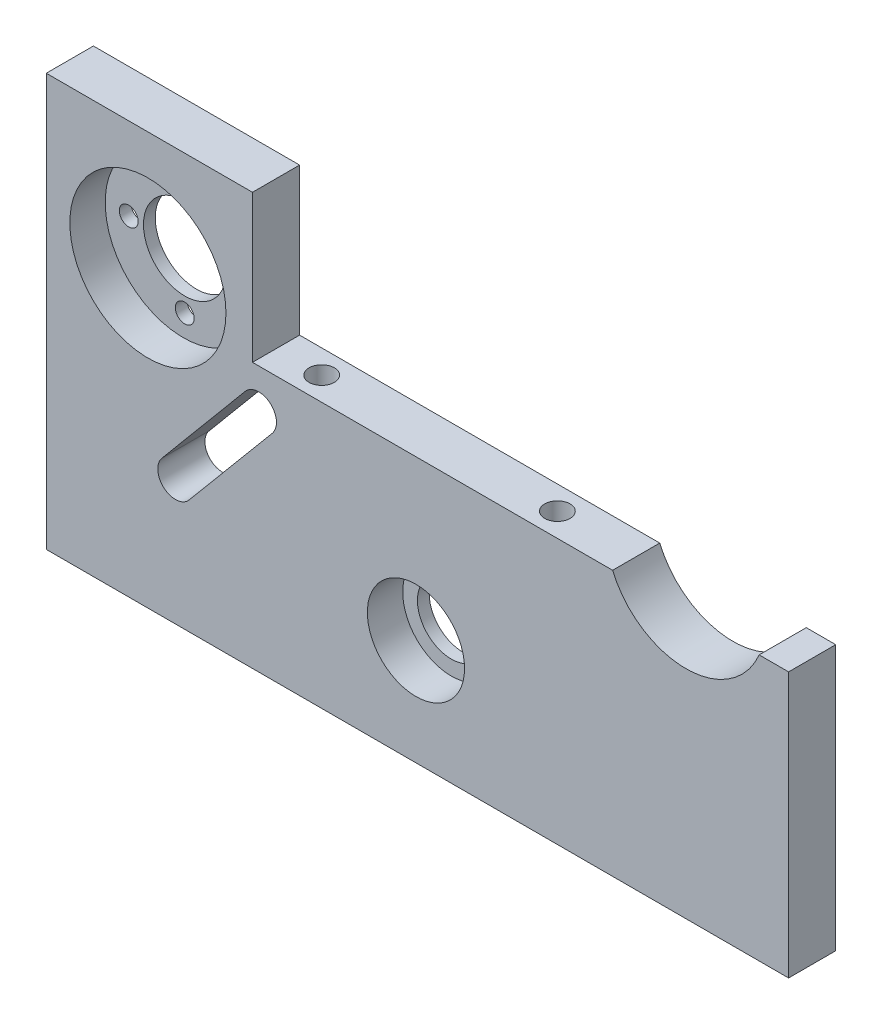
ISO-10303-21;
HEADER;
FILE_DESCRIPTION(('STEP AP214'),'2;1');
FILE_NAME('part.step','',(''),(''),'','','');
FILE_SCHEMA(('AUTOMOTIVE_DESIGN { 1 0 10303 214 1 1 1 1 }'));
ENDSEC;
DATA;
#1=APPLICATION_CONTEXT('core data for automotive mechanical design processes');
#2=APPLICATION_PROTOCOL_DEFINITION('international standard','automotive_design',2000,#1);
#3=PRODUCT_CONTEXT('',#1,'mechanical');
#4=PRODUCT('Part','Part','',(#3));
#5=PRODUCT_RELATED_PRODUCT_CATEGORY('part','',(#4));
#6=PRODUCT_DEFINITION_FORMATION('','',#4);
#7=PRODUCT_DEFINITION_CONTEXT('part definition',#1,'design');
#8=PRODUCT_DEFINITION('design','',#6,#7);
#9=PRODUCT_DEFINITION_SHAPE('','',#8);
#10=(LENGTH_UNIT() NAMED_UNIT(*) SI_UNIT(.MILLI.,.METRE.));
#11=(NAMED_UNIT(*) PLANE_ANGLE_UNIT() SI_UNIT($,.RADIAN.));
#12=(NAMED_UNIT(*) SI_UNIT($,.STERADIAN.) SOLID_ANGLE_UNIT());
#13=UNCERTAINTY_MEASURE_WITH_UNIT(LENGTH_MEASURE(1.E-05),#10,'distance_accuracy_value','');
#14=(GEOMETRIC_REPRESENTATION_CONTEXT(3) GLOBAL_UNCERTAINTY_ASSIGNED_CONTEXT((#13)) GLOBAL_UNIT_ASSIGNED_CONTEXT((#10,
#11,#12)) REPRESENTATION_CONTEXT('',''));
#15=CARTESIAN_POINT('',(0.,0.,0.));
#16=DIRECTION('',(0.,0.,1.));
#17=DIRECTION('',(1.,0.,0.));
#18=AXIS2_PLACEMENT_3D('',#15,#16,#17);
#19=CARTESIAN_POINT('',(72.614420341394,12.6710526315789,8.));
#20=DIRECTION('',(0.,-1.,0.));
#21=DIRECTION('',(1.,0.,0.));
#22=AXIS2_PLACEMENT_3D('',#19,#20,#21);
#23=PLANE('',#22);
#24=DIRECTION('',(-1.,0.,0.));
#25=VECTOR('',#24,1.);
#26=CARTESIAN_POINT('',(72.614420341394,12.6710526315789,0.));
#27=LINE('',#26,#25);
#28=CARTESIAN_POINT('',(72.614420341394,12.6710526315789,0.));
#29=VERTEX_POINT('',#28);
#30=CARTESIAN_POINT('',(67.614420341394,12.6710526315789,0.));
#31=VERTEX_POINT('',#30);
#32=EDGE_CURVE('E261',#29,#31,#27,.T.);
#33=ORIENTED_EDGE('',*,*,#32,.T.);
#34=DIRECTION('',(0.,0.,1.));
#35=VECTOR('',#34,1.);
#36=CARTESIAN_POINT('',(67.614420341394,12.6710526315789,0.));
#37=LINE('',#36,#35);
#38=CARTESIAN_POINT('',(67.614420341394,12.6710526315789,8.));
#39=VERTEX_POINT('',#38);
#40=EDGE_CURVE('E199',#31,#39,#37,.T.);
#41=ORIENTED_EDGE('',*,*,#40,.T.);
#42=DIRECTION('',(-1.,0.,0.));
#43=VECTOR('',#42,1.);
#44=CARTESIAN_POINT('',(72.614420341394,12.6710526315789,8.));
#45=LINE('',#44,#43);
#46=CARTESIAN_POINT('',(72.614420341394,12.6710526315789,8.));
#47=VERTEX_POINT('',#46);
#48=EDGE_CURVE('E246',#47,#39,#45,.T.);
#49=ORIENTED_EDGE('',*,*,#48,.F.);
#50=DIRECTION('',(0.,0.,-1.));
#51=VECTOR('',#50,1.);
#52=CARTESIAN_POINT('',(72.614420341394,12.6710526315789,8.));
#53=LINE('',#52,#51);
#54=EDGE_CURVE('E270',#47,#29,#53,.T.);
#55=ORIENTED_EDGE('',*,*,#54,.T.);
#56=EDGE_LOOP('',(#33,#41,#49,#55));
#57=FACE_BOUND('',#56,.T.);
#58=ADVANCED_FACE('F32',(#57),#23,.F.);
#59=CARTESIAN_POINT('',(-18.385579658606,37.671052631579,8.));
#60=DIRECTION('',(0.,-1.,0.));
#61=DIRECTION('',(1.,0.,0.));
#62=AXIS2_PLACEMENT_3D('',#59,#60,#61);
#63=PLANE('',#62);
#64=DIRECTION('',(-1.,0.,0.));
#65=VECTOR('',#64,1.);
#66=CARTESIAN_POINT('',(-18.385579658606,37.671052631579,0.));
#67=LINE('',#66,#65);
#68=CARTESIAN_POINT('',(-18.385579658606,37.671052631579,0.));
#69=VERTEX_POINT('',#68);
#70=CARTESIAN_POINT('',(-53.385579658606,37.6710526315789,0.));
#71=VERTEX_POINT('',#70);
#72=EDGE_CURVE('E205',#69,#71,#67,.T.);
#73=ORIENTED_EDGE('',*,*,#72,.T.);
#74=DIRECTION('',(0.,0.,-1.));
#75=VECTOR('',#74,1.);
#76=CARTESIAN_POINT('',(-53.385579658606,37.6710526315789,8.));
#77=LINE('',#76,#75);
#78=CARTESIAN_POINT('',(-53.385579658606,37.6710526315789,8.));
#79=VERTEX_POINT('',#78);
#80=EDGE_CURVE('E11',#79,#71,#77,.T.);
#81=ORIENTED_EDGE('',*,*,#80,.F.);
#82=DIRECTION('',(-1.,0.,0.));
#83=VECTOR('',#82,1.);
#84=CARTESIAN_POINT('',(-18.385579658606,37.671052631579,8.));
#85=LINE('',#84,#83);
#86=CARTESIAN_POINT('',(-18.385579658606,37.671052631579,8.));
#87=VERTEX_POINT('',#86);
#88=EDGE_CURVE('E235',#87,#79,#85,.T.);
#89=ORIENTED_EDGE('',*,*,#88,.F.);
#90=DIRECTION('',(0.,0.,-1.));
#91=VECTOR('',#90,1.);
#92=CARTESIAN_POINT('',(-18.385579658606,37.671052631579,8.));
#93=LINE('',#92,#91);
#94=EDGE_CURVE('E251',#87,#69,#93,.T.);
#95=ORIENTED_EDGE('',*,*,#94,.T.);
#96=EDGE_LOOP('',(#73,#81,#89,#95));
#97=FACE_BOUND('',#96,.T.);
#98=ADVANCED_FACE('F34',(#97),#63,.F.);
#99=CARTESIAN_POINT('',(-53.385579658606,37.6710526315789,8.));
#100=DIRECTION('',(1.,0.,0.));
#101=DIRECTION('',(0.,0.,-1.));
#102=AXIS2_PLACEMENT_3D('',#99,#100,#101);
#103=PLANE('',#102);
#104=DIRECTION('',(0.,-1.,0.));
#105=VECTOR('',#104,1.);
#106=CARTESIAN_POINT('',(-53.385579658606,37.6710526315789,0.));
#107=LINE('',#106,#105);
#108=CARTESIAN_POINT('',(-53.385579658606,-32.3289473684211,0.));
#109=VERTEX_POINT('',#108);
#110=EDGE_CURVE('E254',#71,#109,#107,.T.);
#111=ORIENTED_EDGE('',*,*,#110,.T.);
#112=DIRECTION('',(0.,0.,-1.));
#113=VECTOR('',#112,1.);
#114=CARTESIAN_POINT('',(-53.385579658606,-32.3289473684211,8.));
#115=LINE('',#114,#113);
#116=CARTESIAN_POINT('',(-53.385579658606,-32.3289473684211,8.));
#117=VERTEX_POINT('',#116);
#118=EDGE_CURVE('E40',#117,#109,#115,.T.);
#119=ORIENTED_EDGE('',*,*,#118,.F.);
#120=DIRECTION('',(0.,-1.,0.));
#121=VECTOR('',#120,1.);
#122=CARTESIAN_POINT('',(-53.385579658606,37.6710526315789,8.));
#123=LINE('',#122,#121);
#124=EDGE_CURVE('E238',#79,#117,#123,.T.);
#125=ORIENTED_EDGE('',*,*,#124,.F.);
#126=ORIENTED_EDGE('',*,*,#80,.T.);
#127=EDGE_LOOP('',(#111,#119,#125,#126));
#128=FACE_BOUND('',#127,.T.);
#129=ADVANCED_FACE('F302',(#128),#103,.F.);
#130=CARTESIAN_POINT('',(-53.385579658606,-32.3289473684211,8.));
#131=DIRECTION('',(0.,1.,0.));
#132=DIRECTION('',(0.,0.,1.));
#133=AXIS2_PLACEMENT_3D('',#130,#131,#132);
#134=PLANE('',#133);
#135=CARTESIAN_POINT('',(-49.385579658606,-32.3289473684211,3.80027661688586));
#136=DIRECTION('',(0.,-1.,0.));
#137=DIRECTION('',(0.,0.,-1.));
#138=AXIS2_PLACEMENT_3D('',#135,#136,#137);
#139=CIRCLE('',#138,1.75);
#140=CARTESIAN_POINT('',(-49.385579658606,-32.3289473684211,2.05027661688586));
#141=VERTEX_POINT('',#140);
#142=EDGE_CURVE('E638',#141,#141,#139,.T.);
#143=ORIENTED_EDGE('',*,*,#142,.F.);
#144=EDGE_LOOP('',(#143));
#145=FACE_BOUND('',#144,.T.);
#146=CARTESIAN_POINT('',(-14.385579658606,-32.3289473684211,3.80027661688586));
#147=DIRECTION('',(0.,-1.,0.));
#148=DIRECTION('',(0.,0.,-1.));
#149=AXIS2_PLACEMENT_3D('',#146,#147,#148);
#150=CIRCLE('',#149,1.75);
#151=CARTESIAN_POINT('',(-14.385579658606,-32.3289473684211,2.05027661688586));
#152=VERTEX_POINT('',#151);
#153=EDGE_CURVE('E646',#152,#152,#150,.T.);
#154=ORIENTED_EDGE('',*,*,#153,.F.);
#155=EDGE_LOOP('',(#154));
#156=FACE_BOUND('',#155,.T.);
#157=CARTESIAN_POINT('',(37.614420341394,-32.3289473684211,3.80027661688586));
#158=DIRECTION('',(0.,-1.,0.));
#159=DIRECTION('',(0.,0.,-1.));
#160=AXIS2_PLACEMENT_3D('',#157,#158,#159);
#161=CIRCLE('',#160,1.75);
#162=CARTESIAN_POINT('',(37.614420341394,-32.3289473684211,2.05027661688587));
#163=VERTEX_POINT('',#162);
#164=EDGE_CURVE('E652',#163,#163,#161,.T.);
#165=ORIENTED_EDGE('',*,*,#164,.F.);
#166=EDGE_LOOP('',(#165));
#167=FACE_BOUND('',#166,.T.);
#168=CARTESIAN_POINT('',(68.614420341394,-32.3289473684211,3.80027661688586));
#169=DIRECTION('',(0.,-1.,0.));
#170=DIRECTION('',(0.,0.,-1.));
#171=AXIS2_PLACEMENT_3D('',#168,#169,#170);
#172=CIRCLE('',#171,1.75);
#173=CARTESIAN_POINT('',(68.614420341394,-32.3289473684211,2.05027661688587));
#174=VERTEX_POINT('',#173);
#175=EDGE_CURVE('E657',#174,#174,#172,.T.);
#176=ORIENTED_EDGE('',*,*,#175,.F.);
#177=EDGE_LOOP('',(#176));
#178=FACE_BOUND('',#177,.T.);
#179=DIRECTION('',(1.,0.,0.));
#180=VECTOR('',#179,1.);
#181=CARTESIAN_POINT('',(-53.385579658606,-32.3289473684211,0.));
#182=LINE('',#181,#180);
#183=CARTESIAN_POINT('',(72.614420341394,-32.3289473684211,0.));
#184=VERTEX_POINT('',#183);
#185=EDGE_CURVE('E256',#109,#184,#182,.T.);
#186=ORIENTED_EDGE('',*,*,#185,.T.);
#187=DIRECTION('',(0.,0.,-1.));
#188=VECTOR('',#187,1.);
#189=CARTESIAN_POINT('',(72.614420341394,-32.3289473684211,8.));
#190=LINE('',#189,#188);
#191=CARTESIAN_POINT('',(72.614420341394,-32.3289473684211,8.));
#192=VERTEX_POINT('',#191);
#193=EDGE_CURVE('E273',#192,#184,#190,.T.);
#194=ORIENTED_EDGE('',*,*,#193,.F.);
#195=DIRECTION('',(1.,0.,0.));
#196=VECTOR('',#195,1.);
#197=CARTESIAN_POINT('',(-53.385579658606,-32.3289473684211,8.));
#198=LINE('',#197,#196);
#199=EDGE_CURVE('E241',#117,#192,#198,.T.);
#200=ORIENTED_EDGE('',*,*,#199,.F.);
#201=ORIENTED_EDGE('',*,*,#118,.T.);
#202=EDGE_LOOP('',(#186,#194,#200,#201));
#203=FACE_BOUND('',#202,.T.);
#204=ADVANCED_FACE('F280',(#145,#156,#167,#178,#203),#134,.F.);
#205=CARTESIAN_POINT('',(72.614420341394,-32.3289473684211,8.));
#206=DIRECTION('',(-1.,0.,0.));
#207=DIRECTION('',(0.,0.,1.));
#208=AXIS2_PLACEMENT_3D('',#205,#206,#207);
#209=PLANE('',#208);
#210=DIRECTION('',(0.,1.,0.));
#211=VECTOR('',#210,1.);
#212=CARTESIAN_POINT('',(72.614420341394,-32.3289473684211,0.));
#213=LINE('',#212,#211);
#214=EDGE_CURVE('E258',#184,#29,#213,.T.);
#215=ORIENTED_EDGE('',*,*,#214,.T.);
#216=ORIENTED_EDGE('',*,*,#54,.F.);
#217=DIRECTION('',(0.,1.,0.));
#218=VECTOR('',#217,1.);
#219=CARTESIAN_POINT('',(72.614420341394,-32.3289473684211,8.));
#220=LINE('',#219,#218);
#221=EDGE_CURVE('E243',#192,#47,#220,.T.);
#222=ORIENTED_EDGE('',*,*,#221,.F.);
#223=ORIENTED_EDGE('',*,*,#193,.T.);
#224=EDGE_LOOP('',(#215,#216,#222,#223));
#225=FACE_BOUND('',#224,.T.);
#226=ADVANCED_FACE('F291',(#225),#209,.F.);
#227=CARTESIAN_POINT('',(-10.635579658606,12.6710526315789,4.));
#228=DIRECTION('',(0.,1.,0.));
#229=DIRECTION('',(0.,0.,1.));
#230=AXIS2_PLACEMENT_3D('',#227,#228,#229);
#231=CIRCLE('',#230,2.15);
#232=CARTESIAN_POINT('',(-10.635579658606,12.6710526315789,6.15));
#233=VERTEX_POINT('',#232);
#234=EDGE_CURVE('E136',#233,#233,#231,.T.);
#235=ORIENTED_EDGE('',*,*,#234,.F.);
#236=EDGE_LOOP('',(#235));
#237=FACE_BOUND('',#236,.T.);
#238=CARTESIAN_POINT('',(29.364420341394,12.6710526315789,4.));
#239=DIRECTION('',(0.,1.,0.));
#240=DIRECTION('',(0.,0.,1.));
#241=AXIS2_PLACEMENT_3D('',#238,#239,#240);
#242=CIRCLE('',#241,2.15);
#243=CARTESIAN_POINT('',(29.364420341394,12.6710526315789,6.15));
#244=VERTEX_POINT('',#243);
#245=EDGE_CURVE('E135',#244,#244,#242,.T.);
#246=ORIENTED_EDGE('',*,*,#245,.F.);
#247=EDGE_LOOP('',(#246));
#248=FACE_BOUND('',#247,.T.);
#249=CARTESIAN_POINT('',(42.7417262306874,12.6710526315789,8.));
#250=VERTEX_POINT('',#249);
#251=CARTESIAN_POINT('',(-18.385579658606,12.6710526315789,8.));
#252=VERTEX_POINT('',#251);
#253=EDGE_CURVE('E245',#250,#252,#45,.T.);
#254=ORIENTED_EDGE('',*,*,#253,.F.);
#255=DIRECTION('',(0.,0.,1.));
#256=VECTOR('',#255,1.);
#257=CARTESIAN_POINT('',(42.7417262306874,12.6710526315789,0.));
#258=LINE('',#257,#256);
#259=CARTESIAN_POINT('',(42.7417262306874,12.6710526315789,0.));
#260=VERTEX_POINT('',#259);
#261=EDGE_CURVE('E203',#260,#250,#258,.T.);
#262=ORIENTED_EDGE('',*,*,#261,.F.);
#263=CARTESIAN_POINT('',(-18.385579658606,12.6710526315789,0.));
#264=VERTEX_POINT('',#263);
#265=EDGE_CURVE('E260',#260,#264,#27,.T.);
#266=ORIENTED_EDGE('',*,*,#265,.T.);
#267=DIRECTION('',(0.,0.,-1.));
#268=VECTOR('',#267,1.);
#269=CARTESIAN_POINT('',(-18.385579658606,12.6710526315789,8.));
#270=LINE('',#269,#268);
#271=EDGE_CURVE('E267',#252,#264,#270,.T.);
#272=ORIENTED_EDGE('',*,*,#271,.F.);
#273=EDGE_LOOP('',(#254,#262,#266,#272));
#274=FACE_BOUND('',#273,.T.);
#275=ADVANCED_FACE('F311',(#237,#248,#274),#23,.F.);
#276=CARTESIAN_POINT('',(-18.385579658606,12.6710526315789,8.));
#277=DIRECTION('',(-1.,0.,0.));
#278=DIRECTION('',(0.,-1.,0.));
#279=AXIS2_PLACEMENT_3D('',#276,#277,#278);
#280=PLANE('',#279);
#281=DIRECTION('',(0.,1.,0.));
#282=VECTOR('',#281,1.);
#283=CARTESIAN_POINT('',(-18.385579658606,12.6710526315789,0.));
#284=LINE('',#283,#282);
#285=EDGE_CURVE('E239',#264,#69,#284,.T.);
#286=ORIENTED_EDGE('',*,*,#285,.T.);
#287=ORIENTED_EDGE('',*,*,#94,.F.);
#288=DIRECTION('',(0.,1.,0.));
#289=VECTOR('',#288,1.);
#290=CARTESIAN_POINT('',(-18.385579658606,12.6710526315789,8.));
#291=LINE('',#290,#289);
#292=EDGE_CURVE('E249',#252,#87,#291,.T.);
#293=ORIENTED_EDGE('',*,*,#292,.F.);
#294=ORIENTED_EDGE('',*,*,#271,.T.);
#295=EDGE_LOOP('',(#286,#287,#293,#294));
#296=FACE_BOUND('',#295,.T.);
#297=ADVANCED_FACE('F307',(#296),#280,.F.);
#298=CARTESIAN_POINT('',(0.,0.,8.));
#299=DIRECTION('',(0.,0.,1.));
#300=DIRECTION('',(1.,0.,0.));
#301=AXIS2_PLACEMENT_3D('',#298,#299,#300);
#302=PLANE('',#301);
#303=CARTESIAN_POINT('',(-36.135579658606,17.671052631579,8.));
#304=DIRECTION('',(0.,0.,1.));
#305=DIRECTION('',(1.,0.,0.));
#306=AXIS2_PLACEMENT_3D('',#303,#304,#305);
#307=CIRCLE('',#306,13.25);
#308=CARTESIAN_POINT('',(-22.885579658606,17.671052631579,8.));
#309=VERTEX_POINT('',#308);
#310=EDGE_CURVE('E172',#309,#309,#307,.T.);
#311=ORIENTED_EDGE('',*,*,#310,.F.);
#312=EDGE_LOOP('',(#311));
#313=FACE_BOUND('',#312,.T.);
#314=CARTESIAN_POINT('',(9.36442034139401,-14.3289473684211,8.));
#315=DIRECTION('',(0.,0.,1.));
#316=DIRECTION('',(1.,0.,0.));
#317=AXIS2_PLACEMENT_3D('',#314,#315,#316);
#318=CIRCLE('',#317,8.25);
#319=CARTESIAN_POINT('',(17.614420341394,-14.3289473684211,8.));
#320=VERTEX_POINT('',#319);
#321=EDGE_CURVE('E188',#320,#320,#318,.T.);
#322=ORIENTED_EDGE('',*,*,#321,.F.);
#323=EDGE_LOOP('',(#322));
#324=FACE_BOUND('',#323,.T.);
#325=CARTESIAN_POINT('',(55.1780732860407,17.9234113320872,8.));
#326=DIRECTION('',(0.,0.,1.));
#327=DIRECTION('',(-1.,0.,0.));
#328=AXIS2_PLACEMENT_3D('',#325,#326,#327);
#329=CIRCLE('',#328,13.5);
#330=EDGE_CURVE('E200',#250,#39,#329,.T.);
#331=ORIENTED_EDGE('',*,*,#330,.F.);
#332=ORIENTED_EDGE('',*,*,#253,.T.);
#333=ORIENTED_EDGE('',*,*,#292,.T.);
#334=ORIENTED_EDGE('',*,*,#88,.T.);
#335=ORIENTED_EDGE('',*,*,#124,.T.);
#336=ORIENTED_EDGE('',*,*,#199,.T.);
#337=ORIENTED_EDGE('',*,*,#221,.T.);
#338=ORIENTED_EDGE('',*,*,#48,.T.);
#339=EDGE_LOOP('',(#331,#332,#333,#334,#335,#336,#337,#338));
#340=FACE_BOUND('',#339,.T.);
#341=CARTESIAN_POINT('',(-17.311389627984,5.87077961259963,8.));
#342=DIRECTION('',(0.,0.,1.));
#343=DIRECTION('',(-1.,0.,0.));
#344=AXIS2_PLACEMENT_3D('',#341,#342,#343);
#345=CIRCLE('',#344,3.);
#346=CARTESIAN_POINT('',(-15.0111166090047,3.94496964322159,8.));
#347=VERTEX_POINT('',#346);
#348=CARTESIAN_POINT('',(-19.6116626469633,7.79658958197765,8.));
#349=VERTEX_POINT('',#348);
#350=EDGE_CURVE('E47',#347,#349,#345,.T.);
#351=ORIENTED_EDGE('',*,*,#350,.F.);
#352=DIRECTION('',(0.641936656459343,0.766757672993103,0.));
#353=VECTOR('',#352,1.);
#354=CARTESIAN_POINT('',(-15.0111166090047,3.94496964322159,8.));
#355=LINE('',#354,#353);
#356=CARTESIAN_POINT('',(-29.1594966702487,-12.9544843188198,8.));
#357=VERTEX_POINT('',#356);
#358=EDGE_CURVE('E212',#357,#347,#355,.T.);
#359=ORIENTED_EDGE('',*,*,#358,.F.);
#360=CARTESIAN_POINT('',(-31.459769689228,-11.0286743494418,8.));
#361=DIRECTION('',(0.,0.,1.));
#362=DIRECTION('',(1.,0.,0.));
#363=AXIS2_PLACEMENT_3D('',#360,#361,#362);
#364=CIRCLE('',#363,3.);
#365=CARTESIAN_POINT('',(-33.7600427082073,-9.10286438006376,8.));
#366=VERTEX_POINT('',#365);
#367=EDGE_CURVE('E224',#366,#357,#364,.T.);
#368=ORIENTED_EDGE('',*,*,#367,.F.);
#369=DIRECTION('',(-0.641936656459343,-0.766757672993104,0.));
#370=VECTOR('',#369,1.);
#371=CARTESIAN_POINT('',(-19.6116626469633,7.79658958197765,8.));
#372=LINE('',#371,#370);
#373=EDGE_CURVE('E221',#349,#366,#372,.T.);
#374=ORIENTED_EDGE('',*,*,#373,.F.);
#375=EDGE_LOOP('',(#351,#359,#368,#374));
#376=FACE_BOUND('',#375,.T.);
#377=ADVANCED_FACE('F297',(#313,#324,#340,#376),#302,.T.);
#378=CARTESIAN_POINT('',(0.,0.,0.));
#379=DIRECTION('',(0.,0.,1.));
#380=DIRECTION('',(1.,0.,0.));
#381=AXIS2_PLACEMENT_3D('',#378,#379,#380);
#382=PLANE('',#381);
#383=CARTESIAN_POINT('',(-26.385579658606,17.671052631579,0.));
#384=DIRECTION('',(0.,0.,-1.));
#385=DIRECTION('',(-1.,0.,0.));
#386=AXIS2_PLACEMENT_3D('',#383,#384,#385);
#387=CIRCLE('',#386,1.6);
#388=CARTESIAN_POINT('',(-27.985579658606,17.671052631579,0.));
#389=VERTEX_POINT('',#388);
#390=EDGE_CURVE('E148',#389,#389,#387,.T.);
#391=ORIENTED_EDGE('',*,*,#390,.F.);
#392=EDGE_LOOP('',(#391));
#393=FACE_BOUND('',#392,.T.);
#394=CARTESIAN_POINT('',(-35.885579658606,27.171052631579,0.));
#395=DIRECTION('',(0.,0.,-1.));
#396=DIRECTION('',(-1.,0.,0.));
#397=AXIS2_PLACEMENT_3D('',#394,#395,#396);
#398=CIRCLE('',#397,1.6);
#399=CARTESIAN_POINT('',(-37.485579658606,27.171052631579,0.));
#400=VERTEX_POINT('',#399);
#401=EDGE_CURVE('E154',#400,#400,#398,.T.);
#402=ORIENTED_EDGE('',*,*,#401,.F.);
#403=EDGE_LOOP('',(#402));
#404=FACE_BOUND('',#403,.T.);
#405=CARTESIAN_POINT('',(-45.385579658606,17.671052631579,0.));
#406=DIRECTION('',(0.,0.,-1.));
#407=DIRECTION('',(-1.,0.,0.));
#408=AXIS2_PLACEMENT_3D('',#405,#406,#407);
#409=CIRCLE('',#408,1.6);
#410=CARTESIAN_POINT('',(-46.985579658606,17.671052631579,0.));
#411=VERTEX_POINT('',#410);
#412=EDGE_CURVE('E160',#411,#411,#409,.T.);
#413=ORIENTED_EDGE('',*,*,#412,.F.);
#414=EDGE_LOOP('',(#413));
#415=FACE_BOUND('',#414,.T.);
#416=CARTESIAN_POINT('',(-35.885579658606,8.17105263157895,0.));
#417=DIRECTION('',(0.,0.,-1.));
#418=DIRECTION('',(-1.,0.,0.));
#419=AXIS2_PLACEMENT_3D('',#416,#417,#418);
#420=CIRCLE('',#419,1.6);
#421=CARTESIAN_POINT('',(-37.485579658606,8.17105263157895,0.));
#422=VERTEX_POINT('',#421);
#423=EDGE_CURVE('E166',#422,#422,#420,.T.);
#424=ORIENTED_EDGE('',*,*,#423,.F.);
#425=EDGE_LOOP('',(#424));
#426=FACE_BOUND('',#425,.T.);
#427=CARTESIAN_POINT('',(-35.885579658606,17.671052631579,0.));
#428=DIRECTION('',(0.,0.,-1.));
#429=DIRECTION('',(-1.,0.,0.));
#430=AXIS2_PLACEMENT_3D('',#427,#428,#429);
#431=CIRCLE('',#430,7.);
#432=CARTESIAN_POINT('',(-42.885579658606,17.671052631579,0.));
#433=VERTEX_POINT('',#432);
#434=EDGE_CURVE('E181',#433,#433,#431,.T.);
#435=ORIENTED_EDGE('',*,*,#434,.F.);
#436=EDGE_LOOP('',(#435));
#437=FACE_BOUND('',#436,.T.);
#438=CARTESIAN_POINT('',(9.36442034139401,-14.3289473684211,0.));
#439=DIRECTION('',(0.,0.,-1.));
#440=DIRECTION('',(-1.,0.,0.));
#441=AXIS2_PLACEMENT_3D('',#438,#439,#440);
#442=CIRCLE('',#441,5.75);
#443=CARTESIAN_POINT('',(3.61442034139401,-14.3289473684211,0.));
#444=VERTEX_POINT('',#443);
#445=EDGE_CURVE('E184',#444,#444,#442,.T.);
#446=ORIENTED_EDGE('',*,*,#445,.F.);
#447=EDGE_LOOP('',(#446));
#448=FACE_BOUND('',#447,.T.);
#449=DIRECTION('',(0.641936656459343,0.766757672993103,0.));
#450=VECTOR('',#449,1.);
#451=CARTESIAN_POINT('',(-15.0111166090047,3.94496964322159,0.));
#452=LINE('',#451,#450);
#453=CARTESIAN_POINT('',(-29.1594966702487,-12.9544843188198,0.));
#454=VERTEX_POINT('',#453);
#455=CARTESIAN_POINT('',(-15.0111166090047,3.94496964322159,0.));
#456=VERTEX_POINT('',#455);
#457=EDGE_CURVE('E216',#454,#456,#452,.T.);
#458=ORIENTED_EDGE('',*,*,#457,.T.);
#459=CARTESIAN_POINT('',(-17.311389627984,5.87077961259963,0.));
#460=DIRECTION('',(0.,0.,1.));
#461=DIRECTION('',(-1.,0.,0.));
#462=AXIS2_PLACEMENT_3D('',#459,#460,#461);
#463=CIRCLE('',#462,3.);
#464=CARTESIAN_POINT('',(-19.6116626469633,7.79658958197765,0.));
#465=VERTEX_POINT('',#464);
#466=EDGE_CURVE('E208',#456,#465,#463,.T.);
#467=ORIENTED_EDGE('',*,*,#466,.T.);
#468=DIRECTION('',(-0.641936656459343,-0.766757672993104,0.));
#469=VECTOR('',#468,1.);
#470=CARTESIAN_POINT('',(-19.6116626469633,7.79658958197765,0.));
#471=LINE('',#470,#469);
#472=CARTESIAN_POINT('',(-33.7600427082073,-9.10286438006376,0.));
#473=VERTEX_POINT('',#472);
#474=EDGE_CURVE('E211',#465,#473,#471,.T.);
#475=ORIENTED_EDGE('',*,*,#474,.T.);
#476=CARTESIAN_POINT('',(-31.459769689228,-11.0286743494418,0.));
#477=DIRECTION('',(0.,0.,1.));
#478=DIRECTION('',(1.,0.,0.));
#479=AXIS2_PLACEMENT_3D('',#476,#477,#478);
#480=CIRCLE('',#479,3.);
#481=EDGE_CURVE('E55',#473,#454,#480,.T.);
#482=ORIENTED_EDGE('',*,*,#481,.T.);
#483=EDGE_LOOP('',(#458,#467,#475,#482));
#484=FACE_BOUND('',#483,.T.);
#485=ORIENTED_EDGE('',*,*,#265,.F.);
#486=CARTESIAN_POINT('',(55.1780732860407,17.9234113320872,0.));
#487=DIRECTION('',(0.,0.,1.));
#488=DIRECTION('',(-1.,0.,0.));
#489=AXIS2_PLACEMENT_3D('',#486,#487,#488);
#490=CIRCLE('',#489,13.5);
#491=EDGE_CURVE('E196',#260,#31,#490,.T.);
#492=ORIENTED_EDGE('',*,*,#491,.T.);
#493=ORIENTED_EDGE('',*,*,#32,.F.);
#494=ORIENTED_EDGE('',*,*,#214,.F.);
#495=ORIENTED_EDGE('',*,*,#185,.F.);
#496=ORIENTED_EDGE('',*,*,#110,.F.);
#497=ORIENTED_EDGE('',*,*,#72,.F.);
#498=ORIENTED_EDGE('',*,*,#285,.F.);
#499=EDGE_LOOP('',(#485,#492,#493,#494,#495,#496,#497,#498));
#500=FACE_BOUND('',#499,.T.);
#501=ADVANCED_FACE('F286',(#393,#404,#415,#426,#437,#448,#484,#500),#382,.F.);
#502=CARTESIAN_POINT('',(-17.311389627984,5.87077961259963,0.));
#503=DIRECTION('',(0.,0.,1.));
#504=DIRECTION('',(1.,0.,0.));
#505=AXIS2_PLACEMENT_3D('',#502,#503,#504);
#506=CYLINDRICAL_SURFACE('',#505,3.);
#507=ORIENTED_EDGE('',*,*,#350,.T.);
#508=DIRECTION('',(0.,0.,1.));
#509=VECTOR('',#508,1.);
#510=CARTESIAN_POINT('',(-19.6116626469633,7.79658958197765,0.));
#511=LINE('',#510,#509);
#512=EDGE_CURVE('E219',#465,#349,#511,.T.);
#513=ORIENTED_EDGE('',*,*,#512,.F.);
#514=ORIENTED_EDGE('',*,*,#466,.F.);
#515=DIRECTION('',(0.,0.,1.));
#516=VECTOR('',#515,1.);
#517=CARTESIAN_POINT('',(-15.0111166090047,3.94496964322159,0.));
#518=LINE('',#517,#516);
#519=EDGE_CURVE('E202',#456,#347,#518,.T.);
#520=ORIENTED_EDGE('',*,*,#519,.T.);
#521=EDGE_LOOP('',(#507,#513,#514,#520));
#522=FACE_BOUND('',#521,.T.);
#523=ADVANCED_FACE('F407',(#522),#506,.F.);
#524=CARTESIAN_POINT('',(-15.0111166090047,3.94496964322159,0.));
#525=DIRECTION('',(0.766757672993104,-0.641936656459344,0.));
#526=DIRECTION('',(0.641936656459343,0.766757672993103,0.));
#527=AXIS2_PLACEMENT_3D('',#524,#525,#526);
#528=PLANE('',#527);
#529=ORIENTED_EDGE('',*,*,#358,.T.);
#530=ORIENTED_EDGE('',*,*,#519,.F.);
#531=ORIENTED_EDGE('',*,*,#457,.F.);
#532=DIRECTION('',(0.,0.,1.));
#533=VECTOR('',#532,1.);
#534=CARTESIAN_POINT('',(-29.1594966702487,-12.9544843188198,0.));
#535=LINE('',#534,#533);
#536=EDGE_CURVE('E230',#454,#357,#535,.T.);
#537=ORIENTED_EDGE('',*,*,#536,.T.);
#538=EDGE_LOOP('',(#529,#530,#531,#537));
#539=FACE_BOUND('',#538,.T.);
#540=ADVANCED_FACE('F413',(#539),#528,.F.);
#541=CARTESIAN_POINT('',(-31.459769689228,-11.0286743494418,0.));
#542=DIRECTION('',(0.,0.,1.));
#543=DIRECTION('',(1.,0.,0.));
#544=AXIS2_PLACEMENT_3D('',#541,#542,#543);
#545=CYLINDRICAL_SURFACE('',#544,3.);
#546=ORIENTED_EDGE('',*,*,#367,.T.);
#547=ORIENTED_EDGE('',*,*,#536,.F.);
#548=ORIENTED_EDGE('',*,*,#481,.F.);
#549=DIRECTION('',(0.,0.,1.));
#550=VECTOR('',#549,1.);
#551=CARTESIAN_POINT('',(-33.7600427082073,-9.10286438006376,0.));
#552=LINE('',#551,#550);
#553=EDGE_CURVE('E232',#473,#366,#552,.T.);
#554=ORIENTED_EDGE('',*,*,#553,.T.);
#555=EDGE_LOOP('',(#546,#547,#548,#554));
#556=FACE_BOUND('',#555,.T.);
#557=ADVANCED_FACE('F326',(#556),#545,.F.);
#558=CARTESIAN_POINT('',(-19.6116626469633,7.79658958197765,0.));
#559=DIRECTION('',(-0.766757672993104,0.641936656459343,0.));
#560=DIRECTION('',(-0.641936656459343,-0.766757672993104,0.));
#561=AXIS2_PLACEMENT_3D('',#558,#559,#560);
#562=PLANE('',#561);
#563=ORIENTED_EDGE('',*,*,#373,.T.);
#564=ORIENTED_EDGE('',*,*,#553,.F.);
#565=ORIENTED_EDGE('',*,*,#474,.F.);
#566=ORIENTED_EDGE('',*,*,#512,.T.);
#567=EDGE_LOOP('',(#563,#564,#565,#566));
#568=FACE_BOUND('',#567,.T.);
#569=ADVANCED_FACE('F317',(#568),#562,.F.);
#570=CARTESIAN_POINT('',(55.1780732860407,17.9234113320872,0.));
#571=DIRECTION('',(0.,0.,1.));
#572=DIRECTION('',(1.,0.,0.));
#573=AXIS2_PLACEMENT_3D('',#570,#571,#572);
#574=CYLINDRICAL_SURFACE('',#573,13.5);
#575=ORIENTED_EDGE('',*,*,#330,.T.);
#576=ORIENTED_EDGE('',*,*,#40,.F.);
#577=ORIENTED_EDGE('',*,*,#491,.F.);
#578=ORIENTED_EDGE('',*,*,#261,.T.);
#579=EDGE_LOOP('',(#575,#576,#577,#578));
#580=FACE_BOUND('',#579,.T.);
#581=ADVANCED_FACE('F314',(#580),#574,.F.);
#582=CARTESIAN_POINT('',(9.36442034139401,-14.3289473684211,2.));
#583=DIRECTION('',(0.,0.,1.));
#584=DIRECTION('',(1.,0.,0.));
#585=AXIS2_PLACEMENT_3D('',#582,#583,#584);
#586=CYLINDRICAL_SURFACE('',#585,8.25);
#587=CARTESIAN_POINT('',(9.36442034139401,-14.3289473684211,2.));
#588=DIRECTION('',(0.,0.,1.));
#589=DIRECTION('',(1.,0.,0.));
#590=AXIS2_PLACEMENT_3D('',#587,#588,#589);
#591=CIRCLE('',#590,8.25);
#592=CARTESIAN_POINT('',(17.614420341394,-14.3289473684211,2.));
#593=VERTEX_POINT('',#592);
#594=EDGE_CURVE('E191',#593,#593,#591,.T.);
#595=ORIENTED_EDGE('',*,*,#594,.F.);
#596=EDGE_LOOP('',(#595));
#597=FACE_BOUND('',#596,.T.);
#598=ORIENTED_EDGE('',*,*,#321,.T.);
#599=EDGE_LOOP('',(#598));
#600=FACE_BOUND('',#599,.T.);
#601=ADVANCED_FACE('F316',(#597,#600),#586,.F.);
#602=CARTESIAN_POINT('',(9.36442034139401,-14.3289473684211,2.));
#603=DIRECTION('',(0.,0.,1.));
#604=DIRECTION('',(1.,0.,0.));
#605=AXIS2_PLACEMENT_3D('',#602,#603,#604);
#606=PLANE('',#605);
#607=CARTESIAN_POINT('',(9.36442034139401,-14.3289473684211,2.));
#608=DIRECTION('',(0.,0.,-1.));
#609=DIRECTION('',(-1.,0.,0.));
#610=AXIS2_PLACEMENT_3D('',#607,#608,#609);
#611=CIRCLE('',#610,5.75);
#612=CARTESIAN_POINT('',(3.61442034139401,-14.3289473684211,2.));
#613=VERTEX_POINT('',#612);
#614=EDGE_CURVE('E185',#613,#613,#611,.T.);
#615=ORIENTED_EDGE('',*,*,#614,.T.);
#616=EDGE_LOOP('',(#615));
#617=FACE_BOUND('',#616,.T.);
#618=ORIENTED_EDGE('',*,*,#594,.T.);
#619=EDGE_LOOP('',(#618));
#620=FACE_BOUND('',#619,.T.);
#621=ADVANCED_FACE('F323',(#617,#620),#606,.T.);
#622=CARTESIAN_POINT('',(9.36442034139401,-14.3289473684211,2.));
#623=DIRECTION('',(0.,0.,-1.));
#624=DIRECTION('',(-1.,0.,0.));
#625=AXIS2_PLACEMENT_3D('',#622,#623,#624);
#626=CYLINDRICAL_SURFACE('',#625,5.75);
#627=ORIENTED_EDGE('',*,*,#614,.F.);
#628=EDGE_LOOP('',(#627));
#629=FACE_BOUND('',#628,.T.);
#630=ORIENTED_EDGE('',*,*,#445,.T.);
#631=EDGE_LOOP('',(#630));
#632=FACE_BOUND('',#631,.T.);
#633=ADVANCED_FACE('F386',(#629,#632),#626,.F.);
#634=CARTESIAN_POINT('',(-35.885579658606,17.671052631579,2.));
#635=DIRECTION('',(0.,0.,-1.));
#636=DIRECTION('',(-1.,0.,0.));
#637=AXIS2_PLACEMENT_3D('',#634,#635,#636);
#638=CYLINDRICAL_SURFACE('',#637,7.);
#639=CARTESIAN_POINT('',(-35.885579658606,17.671052631579,2.));
#640=DIRECTION('',(0.,0.,-1.));
#641=DIRECTION('',(-1.,0.,0.));
#642=AXIS2_PLACEMENT_3D('',#639,#640,#641);
#643=CIRCLE('',#642,7.);
#644=CARTESIAN_POINT('',(-42.885579658606,17.671052631579,2.));
#645=VERTEX_POINT('',#644);
#646=EDGE_CURVE('E176',#645,#645,#643,.T.);
#647=ORIENTED_EDGE('',*,*,#646,.F.);
#648=EDGE_LOOP('',(#647));
#649=FACE_BOUND('',#648,.T.);
#650=ORIENTED_EDGE('',*,*,#434,.T.);
#651=EDGE_LOOP('',(#650));
#652=FACE_BOUND('',#651,.T.);
#653=ADVANCED_FACE('F379',(#649,#652),#638,.F.);
#654=CARTESIAN_POINT('',(-36.135579658606,17.671052631579,2.));
#655=DIRECTION('',(0.,0.,1.));
#656=DIRECTION('',(1.,0.,0.));
#657=AXIS2_PLACEMENT_3D('',#654,#655,#656);
#658=PLANE('',#657);
#659=CARTESIAN_POINT('',(-26.385579658606,17.671052631579,2.));
#660=DIRECTION('',(0.,0.,1.));
#661=DIRECTION('',(1.,0.,0.));
#662=AXIS2_PLACEMENT_3D('',#659,#660,#661);
#663=CIRCLE('',#662,1.6);
#664=CARTESIAN_POINT('',(-24.785579658606,17.671052631579,2.));
#665=VERTEX_POINT('',#664);
#666=EDGE_CURVE('E151',#665,#665,#663,.T.);
#667=ORIENTED_EDGE('',*,*,#666,.F.);
#668=EDGE_LOOP('',(#667));
#669=FACE_BOUND('',#668,.T.);
#670=CARTESIAN_POINT('',(-35.885579658606,27.171052631579,2.));
#671=DIRECTION('',(0.,0.,1.));
#672=DIRECTION('',(1.,0.,0.));
#673=AXIS2_PLACEMENT_3D('',#670,#671,#672);
#674=CIRCLE('',#673,1.6);
#675=CARTESIAN_POINT('',(-34.285579658606,27.171052631579,2.));
#676=VERTEX_POINT('',#675);
#677=EDGE_CURVE('E157',#676,#676,#674,.T.);
#678=ORIENTED_EDGE('',*,*,#677,.F.);
#679=EDGE_LOOP('',(#678));
#680=FACE_BOUND('',#679,.T.);
#681=CARTESIAN_POINT('',(-45.385579658606,17.671052631579,2.));
#682=DIRECTION('',(0.,0.,1.));
#683=DIRECTION('',(1.,0.,0.));
#684=AXIS2_PLACEMENT_3D('',#681,#682,#683);
#685=CIRCLE('',#684,1.6);
#686=CARTESIAN_POINT('',(-43.785579658606,17.671052631579,2.));
#687=VERTEX_POINT('',#686);
#688=EDGE_CURVE('E163',#687,#687,#685,.T.);
#689=ORIENTED_EDGE('',*,*,#688,.F.);
#690=EDGE_LOOP('',(#689));
#691=FACE_BOUND('',#690,.T.);
#692=CARTESIAN_POINT('',(-35.885579658606,8.17105263157895,2.));
#693=DIRECTION('',(0.,0.,1.));
#694=DIRECTION('',(1.,0.,0.));
#695=AXIS2_PLACEMENT_3D('',#692,#693,#694);
#696=CIRCLE('',#695,1.6);
#697=CARTESIAN_POINT('',(-34.285579658606,8.17105263157895,2.));
#698=VERTEX_POINT('',#697);
#699=EDGE_CURVE('E169',#698,#698,#696,.T.);
#700=ORIENTED_EDGE('',*,*,#699,.F.);
#701=EDGE_LOOP('',(#700));
#702=FACE_BOUND('',#701,.T.);
#703=CARTESIAN_POINT('',(-36.135579658606,17.671052631579,2.));
#704=DIRECTION('',(0.,0.,1.));
#705=DIRECTION('',(1.,0.,0.));
#706=AXIS2_PLACEMENT_3D('',#703,#704,#705);
#707=CIRCLE('',#706,13.25);
#708=CARTESIAN_POINT('',(-22.885579658606,17.671052631579,2.));
#709=VERTEX_POINT('',#708);
#710=EDGE_CURVE('E173',#709,#709,#707,.T.);
#711=ORIENTED_EDGE('',*,*,#710,.T.);
#712=EDGE_LOOP('',(#711));
#713=FACE_BOUND('',#712,.T.);
#714=ORIENTED_EDGE('',*,*,#646,.T.);
#715=EDGE_LOOP('',(#714));
#716=FACE_BOUND('',#715,.T.);
#717=ADVANCED_FACE('F376',(#669,#680,#691,#702,#713,#716),#658,.T.);
#718=CARTESIAN_POINT('',(-36.135579658606,17.671052631579,2.));
#719=DIRECTION('',(0.,0.,1.));
#720=DIRECTION('',(1.,0.,0.));
#721=AXIS2_PLACEMENT_3D('',#718,#719,#720);
#722=CYLINDRICAL_SURFACE('',#721,13.25);
#723=ORIENTED_EDGE('',*,*,#710,.F.);
#724=EDGE_LOOP('',(#723));
#725=FACE_BOUND('',#724,.T.);
#726=ORIENTED_EDGE('',*,*,#310,.T.);
#727=EDGE_LOOP('',(#726));
#728=FACE_BOUND('',#727,.T.);
#729=ADVANCED_FACE('F374',(#725,#728),#722,.F.);
#730=CARTESIAN_POINT('',(-35.885579658606,8.17105263157895,0.));
#731=DIRECTION('',(0.,0.,-1.));
#732=DIRECTION('',(-1.,0.,0.));
#733=AXIS2_PLACEMENT_3D('',#730,#731,#732);
#734=CYLINDRICAL_SURFACE('',#733,1.6);
#735=ORIENTED_EDGE('',*,*,#699,.T.);
#736=EDGE_LOOP('',(#735));
#737=FACE_BOUND('',#736,.T.);
#738=ORIENTED_EDGE('',*,*,#423,.T.);
#739=EDGE_LOOP('',(#738));
#740=FACE_BOUND('',#739,.T.);
#741=ADVANCED_FACE('F370',(#737,#740),#734,.F.);
#742=CARTESIAN_POINT('',(-45.385579658606,17.671052631579,0.));
#743=DIRECTION('',(0.,0.,-1.));
#744=DIRECTION('',(-1.,0.,0.));
#745=AXIS2_PLACEMENT_3D('',#742,#743,#744);
#746=CYLINDRICAL_SURFACE('',#745,1.6);
#747=ORIENTED_EDGE('',*,*,#688,.T.);
#748=EDGE_LOOP('',(#747));
#749=FACE_BOUND('',#748,.T.);
#750=ORIENTED_EDGE('',*,*,#412,.T.);
#751=EDGE_LOOP('',(#750));
#752=FACE_BOUND('',#751,.T.);
#753=ADVANCED_FACE('F366',(#749,#752),#746,.F.);
#754=CARTESIAN_POINT('',(-35.885579658606,27.171052631579,0.));
#755=DIRECTION('',(0.,0.,-1.));
#756=DIRECTION('',(-1.,0.,0.));
#757=AXIS2_PLACEMENT_3D('',#754,#755,#756);
#758=CYLINDRICAL_SURFACE('',#757,1.6);
#759=ORIENTED_EDGE('',*,*,#677,.T.);
#760=EDGE_LOOP('',(#759));
#761=FACE_BOUND('',#760,.T.);
#762=ORIENTED_EDGE('',*,*,#401,.T.);
#763=EDGE_LOOP('',(#762));
#764=FACE_BOUND('',#763,.T.);
#765=ADVANCED_FACE('F362',(#761,#764),#758,.F.);
#766=CARTESIAN_POINT('',(-26.385579658606,17.671052631579,0.));
#767=DIRECTION('',(0.,0.,-1.));
#768=DIRECTION('',(-1.,0.,0.));
#769=AXIS2_PLACEMENT_3D('',#766,#767,#768);
#770=CYLINDRICAL_SURFACE('',#769,1.6);
#771=ORIENTED_EDGE('',*,*,#666,.T.);
#772=EDGE_LOOP('',(#771));
#773=FACE_BOUND('',#772,.T.);
#774=ORIENTED_EDGE('',*,*,#390,.T.);
#775=EDGE_LOOP('',(#774));
#776=FACE_BOUND('',#775,.T.);
#777=ADVANCED_FACE('F354',(#773,#776),#770,.F.);
#778=CARTESIAN_POINT('',(29.364420341394,2.67105263157893,4.));
#779=DIRECTION('',(0.,1.,0.));
#780=DIRECTION('',(0.,0.,1.));
#781=AXIS2_PLACEMENT_3D('',#778,#779,#780);
#782=CONICAL_SURFACE('',#781,2.15,1.02974425867665);
#783=CARTESIAN_POINT('',(29.364420341394,1.37920230066968,4.));
#784=VERTEX_POINT('',#783);
#785=VERTEX_LOOP('',#784);
#786=FACE_BOUND('',#785,.T.);
#787=CARTESIAN_POINT('',(29.364420341394,2.67105263157893,4.));
#788=DIRECTION('',(0.,1.,0.));
#789=DIRECTION('',(0.,0.,1.));
#790=AXIS2_PLACEMENT_3D('',#787,#788,#789);
#791=CIRCLE('',#790,2.15);
#792=CARTESIAN_POINT('',(29.364420341394,2.67105263157893,6.15));
#793=VERTEX_POINT('',#792);
#794=EDGE_CURVE('E139',#793,#793,#791,.T.);
#795=ORIENTED_EDGE('',*,*,#794,.T.);
#796=EDGE_LOOP('',(#795));
#797=FACE_BOUND('',#796,.T.);
#798=ADVANCED_FACE('F348',(#786,#797),#782,.F.);
#799=CARTESIAN_POINT('',(29.364420341394,12.6710526315789,4.));
#800=DIRECTION('',(0.,1.,0.));
#801=DIRECTION('',(0.,0.,1.));
#802=AXIS2_PLACEMENT_3D('',#799,#800,#801);
#803=CYLINDRICAL_SURFACE('',#802,2.15);
#804=ORIENTED_EDGE('',*,*,#794,.F.);
#805=EDGE_LOOP('',(#804));
#806=FACE_BOUND('',#805,.T.);
#807=ORIENTED_EDGE('',*,*,#245,.T.);
#808=EDGE_LOOP('',(#807));
#809=FACE_BOUND('',#808,.T.);
#810=ADVANCED_FACE('F129',(#806,#809),#803,.F.);
#811=CARTESIAN_POINT('',(-10.635579658606,2.67105263157893,4.));
#812=DIRECTION('',(0.,1.,0.));
#813=DIRECTION('',(0.,0.,1.));
#814=AXIS2_PLACEMENT_3D('',#811,#812,#813);
#815=CONICAL_SURFACE('',#814,2.15,1.02974425867665);
#816=CARTESIAN_POINT('',(-10.635579658606,1.37920230066967,4.));
#817=VERTEX_POINT('',#816);
#818=VERTEX_LOOP('',#817);
#819=FACE_BOUND('',#818,.T.);
#820=CARTESIAN_POINT('',(-10.635579658606,2.67105263157893,4.));
#821=DIRECTION('',(0.,1.,0.));
#822=DIRECTION('',(0.,0.,1.));
#823=AXIS2_PLACEMENT_3D('',#820,#821,#822);
#824=CIRCLE('',#823,2.15);
#825=CARTESIAN_POINT('',(-10.635579658606,2.67105263157893,6.15));
#826=VERTEX_POINT('',#825);
#827=EDGE_CURVE('E133',#826,#826,#824,.T.);
#828=ORIENTED_EDGE('',*,*,#827,.T.);
#829=EDGE_LOOP('',(#828));
#830=FACE_BOUND('',#829,.T.);
#831=ADVANCED_FACE('F125',(#819,#830),#815,.F.);
#832=CARTESIAN_POINT('',(-10.635579658606,12.6710526315789,4.));
#833=DIRECTION('',(0.,1.,0.));
#834=DIRECTION('',(0.,0.,1.));
#835=AXIS2_PLACEMENT_3D('',#832,#833,#834);
#836=CYLINDRICAL_SURFACE('',#835,2.15);
#837=ORIENTED_EDGE('',*,*,#827,.F.);
#838=EDGE_LOOP('',(#837));
#839=FACE_BOUND('',#838,.T.);
#840=ORIENTED_EDGE('',*,*,#234,.T.);
#841=EDGE_LOOP('',(#840));
#842=FACE_BOUND('',#841,.T.);
#843=ADVANCED_FACE('F128',(#839,#842),#836,.F.);
#844=CARTESIAN_POINT('',(68.614420341394,-22.3289473684211,3.80027661688586));
#845=DIRECTION('',(0.,-1.,0.));
#846=DIRECTION('',(0.,0.,-1.));
#847=AXIS2_PLACEMENT_3D('',#844,#845,#846);
#848=CYLINDRICAL_SURFACE('',#847,1.75);
#849=CARTESIAN_POINT('',(68.614420341394,-22.3289473684211,3.80027661688586));
#850=DIRECTION('',(0.,-1.,0.));
#851=DIRECTION('',(0.,0.,-1.));
#852=AXIS2_PLACEMENT_3D('',#849,#850,#851);
#853=CIRCLE('',#852,1.75);
#854=CARTESIAN_POINT('',(68.614420341394,-22.3289473684211,2.05027661688587));
#855=VERTEX_POINT('',#854);
#856=EDGE_CURVE('E655',#855,#855,#853,.T.);
#857=ORIENTED_EDGE('',*,*,#856,.F.);
#858=EDGE_LOOP('',(#857));
#859=FACE_BOUND('',#858,.T.);
#860=ORIENTED_EDGE('',*,*,#175,.T.);
#861=EDGE_LOOP('',(#860));
#862=FACE_BOUND('',#861,.T.);
#863=ADVANCED_FACE('F543',(#859,#862),#848,.F.);
#864=CARTESIAN_POINT('',(68.614420341394,-22.3289473684211,3.80027661688586));
#865=DIRECTION('',(0.,-1.,0.));
#866=DIRECTION('',(0.,0.,-1.));
#867=AXIS2_PLACEMENT_3D('',#864,#865,#866);
#868=PLANE('',#867);
#869=ORIENTED_EDGE('',*,*,#856,.T.);
#870=EDGE_LOOP('',(#869));
#871=FACE_BOUND('',#870,.T.);
#872=ADVANCED_FACE('F562',(#871),#868,.T.);
#873=CARTESIAN_POINT('',(37.614420341394,-22.3289473684211,3.80027661688586));
#874=DIRECTION('',(0.,-1.,0.));
#875=DIRECTION('',(0.,0.,-1.));
#876=AXIS2_PLACEMENT_3D('',#873,#874,#875);
#877=CYLINDRICAL_SURFACE('',#876,1.75);
#878=CARTESIAN_POINT('',(37.614420341394,-22.3289473684211,3.80027661688586));
#879=DIRECTION('',(0.,-1.,0.));
#880=DIRECTION('',(0.,0.,-1.));
#881=AXIS2_PLACEMENT_3D('',#878,#879,#880);
#882=CIRCLE('',#881,1.75);
#883=CARTESIAN_POINT('',(37.614420341394,-22.3289473684211,2.05027661688587));
#884=VERTEX_POINT('',#883);
#885=EDGE_CURVE('E649',#884,#884,#882,.T.);
#886=ORIENTED_EDGE('',*,*,#885,.F.);
#887=EDGE_LOOP('',(#886));
#888=FACE_BOUND('',#887,.T.);
#889=ORIENTED_EDGE('',*,*,#164,.T.);
#890=EDGE_LOOP('',(#889));
#891=FACE_BOUND('',#890,.T.);
#892=ADVANCED_FACE('F572',(#888,#891),#877,.F.);
#893=CARTESIAN_POINT('',(37.614420341394,-22.3289473684211,3.80027661688586));
#894=DIRECTION('',(0.,-1.,0.));
#895=DIRECTION('',(0.,0.,-1.));
#896=AXIS2_PLACEMENT_3D('',#893,#894,#895);
#897=PLANE('',#896);
#898=ORIENTED_EDGE('',*,*,#885,.T.);
#899=EDGE_LOOP('',(#898));
#900=FACE_BOUND('',#899,.T.);
#901=ADVANCED_FACE('F582',(#900),#897,.T.);
#902=CARTESIAN_POINT('',(-14.385579658606,-22.3289473684211,3.80027661688586));
#903=DIRECTION('',(0.,-1.,0.));
#904=DIRECTION('',(0.,0.,-1.));
#905=AXIS2_PLACEMENT_3D('',#902,#903,#904);
#906=CYLINDRICAL_SURFACE('',#905,1.75);
#907=CARTESIAN_POINT('',(-14.385579658606,-22.3289473684211,3.80027661688586));
#908=DIRECTION('',(0.,-1.,0.));
#909=DIRECTION('',(0.,0.,-1.));
#910=AXIS2_PLACEMENT_3D('',#907,#908,#909);
#911=CIRCLE('',#910,1.75);
#912=CARTESIAN_POINT('',(-14.385579658606,-22.3289473684211,2.05027661688586));
#913=VERTEX_POINT('',#912);
#914=EDGE_CURVE('E641',#913,#913,#911,.T.);
#915=ORIENTED_EDGE('',*,*,#914,.F.);
#916=EDGE_LOOP('',(#915));
#917=FACE_BOUND('',#916,.T.);
#918=ORIENTED_EDGE('',*,*,#153,.T.);
#919=EDGE_LOOP('',(#918));
#920=FACE_BOUND('',#919,.T.);
#921=ADVANCED_FACE('F592',(#917,#920),#906,.F.);
#922=CARTESIAN_POINT('',(-14.385579658606,-22.3289473684211,3.80027661688586));
#923=DIRECTION('',(0.,-1.,0.));
#924=DIRECTION('',(0.,0.,-1.));
#925=AXIS2_PLACEMENT_3D('',#922,#923,#924);
#926=PLANE('',#925);
#927=ORIENTED_EDGE('',*,*,#914,.T.);
#928=EDGE_LOOP('',(#927));
#929=FACE_BOUND('',#928,.T.);
#930=ADVANCED_FACE('F602',(#929),#926,.T.);
#931=CARTESIAN_POINT('',(-49.385579658606,-22.3289473684211,3.80027661688586));
#932=DIRECTION('',(0.,-1.,0.));
#933=DIRECTION('',(0.,0.,-1.));
#934=AXIS2_PLACEMENT_3D('',#931,#932,#933);
#935=CYLINDRICAL_SURFACE('',#934,1.75);
#936=CARTESIAN_POINT('',(-49.385579658606,-22.3289473684211,3.80027661688586));
#937=DIRECTION('',(0.,-1.,0.));
#938=DIRECTION('',(0.,0.,-1.));
#939=AXIS2_PLACEMENT_3D('',#936,#937,#938);
#940=CIRCLE('',#939,1.75);
#941=CARTESIAN_POINT('',(-49.385579658606,-22.3289473684211,2.05027661688586));
#942=VERTEX_POINT('',#941);
#943=EDGE_CURVE('E142',#942,#942,#940,.T.);
#944=ORIENTED_EDGE('',*,*,#943,.F.);
#945=EDGE_LOOP('',(#944));
#946=FACE_BOUND('',#945,.T.);
#947=ORIENTED_EDGE('',*,*,#142,.T.);
#948=EDGE_LOOP('',(#947));
#949=FACE_BOUND('',#948,.T.);
#950=ADVANCED_FACE('F612',(#946,#949),#935,.F.);
#951=CARTESIAN_POINT('',(-49.385579658606,-22.3289473684211,3.80027661688586));
#952=DIRECTION('',(0.,-1.,0.));
#953=DIRECTION('',(0.,0.,-1.));
#954=AXIS2_PLACEMENT_3D('',#951,#952,#953);
#955=PLANE('',#954);
#956=ORIENTED_EDGE('',*,*,#943,.T.);
#957=EDGE_LOOP('',(#956));
#958=FACE_BOUND('',#957,.T.);
#959=ADVANCED_FACE('F622',(#958),#955,.T.);
#960=CLOSED_SHELL('',(#58,#98,#129,#204,#226,#275,#297,#377,#501,#523,#540,#557,#569,#581,#601,
#621,#633,#653,#717,#729,#741,#753,#765,#777,#798,#810,#831,#843,#863,#872,#892,#901,#921,#930,
#950,#959));
#961=MANIFOLD_SOLID_BREP('B2',#960);
#962=ADVANCED_BREP_SHAPE_REPRESENTATION('',(#18,#961),#14);
#963=SHAPE_DEFINITION_REPRESENTATION(#9,#962);
ENDSEC;
END-ISO-10303-21;
